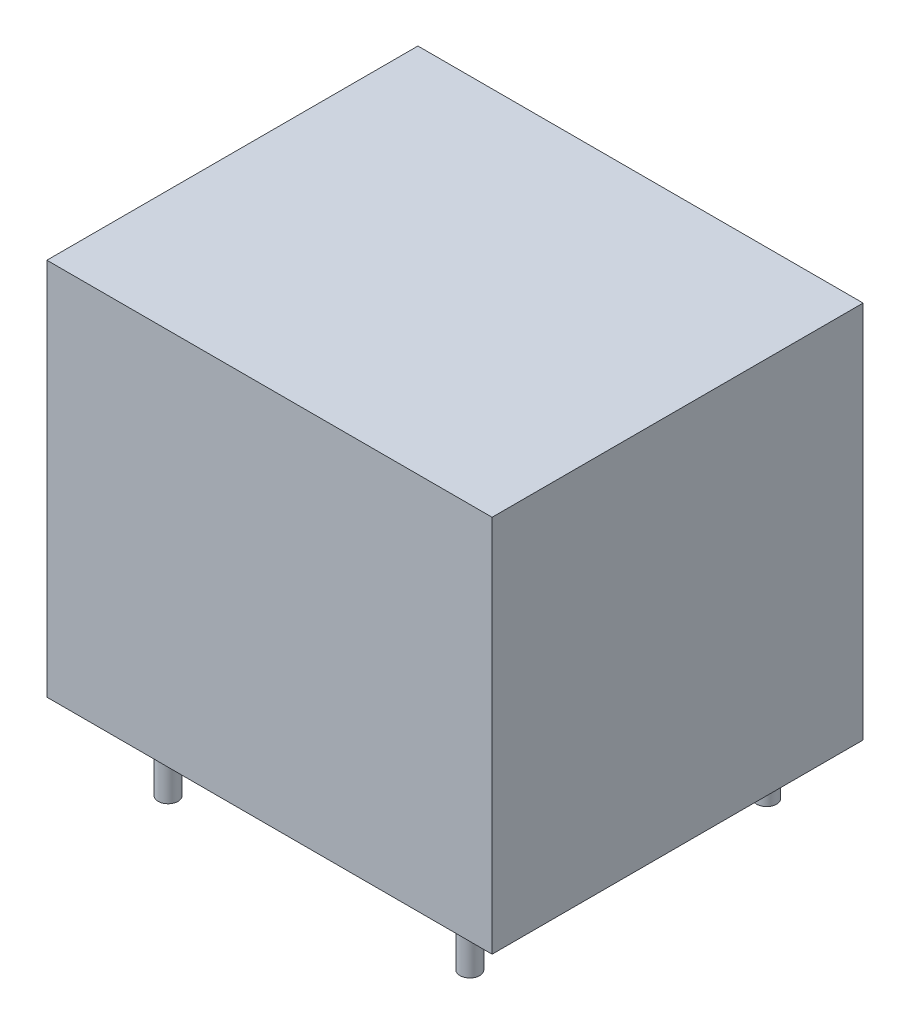
ISO-10303-21;
HEADER;
FILE_DESCRIPTION(('STEP AP214'),'2;1');
FILE_NAME('part.step','',(''),(''),'','','');
FILE_SCHEMA(('AUTOMOTIVE_DESIGN { 1 0 10303 214 1 1 1 1 }'));
ENDSEC;
DATA;
#1=APPLICATION_CONTEXT('core data for automotive mechanical design processes');
#2=APPLICATION_PROTOCOL_DEFINITION('international standard','automotive_design',2000,#1);
#3=PRODUCT_CONTEXT('',#1,'mechanical');
#4=PRODUCT('Part','Part','',(#3));
#5=PRODUCT_RELATED_PRODUCT_CATEGORY('part','',(#4));
#6=PRODUCT_DEFINITION_FORMATION('','',#4);
#7=PRODUCT_DEFINITION_CONTEXT('part definition',#1,'design');
#8=PRODUCT_DEFINITION('design','',#6,#7);
#9=PRODUCT_DEFINITION_SHAPE('','',#8);
#10=(LENGTH_UNIT() NAMED_UNIT(*) SI_UNIT(.MILLI.,.METRE.));
#11=(NAMED_UNIT(*) PLANE_ANGLE_UNIT() SI_UNIT($,.RADIAN.));
#12=(NAMED_UNIT(*) SI_UNIT($,.STERADIAN.) SOLID_ANGLE_UNIT());
#13=UNCERTAINTY_MEASURE_WITH_UNIT(LENGTH_MEASURE(1.E-05),#10,'distance_accuracy_value','');
#14=(GEOMETRIC_REPRESENTATION_CONTEXT(3) GLOBAL_UNCERTAINTY_ASSIGNED_CONTEXT((#13)) GLOBAL_UNIT_ASSIGNED_CONTEXT((#10,
#11,#12)) REPRESENTATION_CONTEXT('',''));
#15=CARTESIAN_POINT('',(0.,0.,0.));
#16=DIRECTION('',(0.,0.,1.));
#17=DIRECTION('',(1.,0.,0.));
#18=AXIS2_PLACEMENT_3D('',#15,#16,#17);
#19=CARTESIAN_POINT('',(-9.,15.3,-7.5));
#20=DIRECTION('',(1.,0.,0.));
#21=DIRECTION('',(0.,0.,-1.));
#22=AXIS2_PLACEMENT_3D('',#19,#20,#21);
#23=PLANE('',#22);
#24=DIRECTION('',(0.,0.,1.));
#25=VECTOR('',#24,1.);
#26=CARTESIAN_POINT('',(-9.,0.,-7.5));
#27=LINE('',#26,#25);
#28=CARTESIAN_POINT('',(-9.,0.,-7.5));
#29=VERTEX_POINT('',#28);
#30=CARTESIAN_POINT('',(-9.,0.,7.5));
#31=VERTEX_POINT('',#30);
#32=EDGE_CURVE('E101',#29,#31,#27,.T.);
#33=ORIENTED_EDGE('',*,*,#32,.T.);
#34=DIRECTION('',(0.,-1.,0.));
#35=VECTOR('',#34,1.);
#36=CARTESIAN_POINT('',(-9.,15.3,7.5));
#37=LINE('',#36,#35);
#38=CARTESIAN_POINT('',(-9.,15.3,7.5));
#39=VERTEX_POINT('',#38);
#40=EDGE_CURVE('E92',#39,#31,#37,.T.);
#41=ORIENTED_EDGE('',*,*,#40,.F.);
#42=DIRECTION('',(0.,0.,1.));
#43=VECTOR('',#42,1.);
#44=CARTESIAN_POINT('',(-9.,15.3,-7.5));
#45=LINE('',#44,#43);
#46=CARTESIAN_POINT('',(-9.,15.3,-7.5));
#47=VERTEX_POINT('',#46);
#48=EDGE_CURVE('E86',#47,#39,#45,.T.);
#49=ORIENTED_EDGE('',*,*,#48,.F.);
#50=DIRECTION('',(0.,-1.,0.));
#51=VECTOR('',#50,1.);
#52=CARTESIAN_POINT('',(-9.,15.3,-7.5));
#53=LINE('',#52,#51);
#54=EDGE_CURVE('E97',#47,#29,#53,.T.);
#55=ORIENTED_EDGE('',*,*,#54,.T.);
#56=EDGE_LOOP('',(#33,#41,#49,#55));
#57=FACE_BOUND('',#56,.T.);
#58=ADVANCED_FACE('F34',(#57),#23,.F.);
#59=CARTESIAN_POINT('',(-9.,15.3,7.5));
#60=DIRECTION('',(0.,0.,-1.));
#61=DIRECTION('',(-1.,0.,0.));
#62=AXIS2_PLACEMENT_3D('',#59,#60,#61);
#63=PLANE('',#62);
#64=DIRECTION('',(1.,0.,0.));
#65=VECTOR('',#64,1.);
#66=CARTESIAN_POINT('',(-9.,0.,7.5));
#67=LINE('',#66,#65);
#68=CARTESIAN_POINT('',(9.,0.,7.5));
#69=VERTEX_POINT('',#68);
#70=EDGE_CURVE('E91',#31,#69,#67,.T.);
#71=ORIENTED_EDGE('',*,*,#70,.T.);
#72=DIRECTION('',(0.,-1.,0.));
#73=VECTOR('',#72,1.);
#74=CARTESIAN_POINT('',(9.,15.3,7.5));
#75=LINE('',#74,#73);
#76=CARTESIAN_POINT('',(9.,15.3,7.5));
#77=VERTEX_POINT('',#76);
#78=EDGE_CURVE('E89',#77,#69,#75,.T.);
#79=ORIENTED_EDGE('',*,*,#78,.F.);
#80=DIRECTION('',(1.,0.,0.));
#81=VECTOR('',#80,1.);
#82=CARTESIAN_POINT('',(-9.,15.3,7.5));
#83=LINE('',#82,#81);
#84=EDGE_CURVE('E81',#39,#77,#83,.T.);
#85=ORIENTED_EDGE('',*,*,#84,.F.);
#86=ORIENTED_EDGE('',*,*,#40,.T.);
#87=EDGE_LOOP('',(#71,#79,#85,#86));
#88=FACE_BOUND('',#87,.T.);
#89=ADVANCED_FACE('F90',(#88),#63,.F.);
#90=CARTESIAN_POINT('',(9.,15.3,-7.5));
#91=DIRECTION('',(-1.,0.,0.));
#92=DIRECTION('',(0.,0.,1.));
#93=AXIS2_PLACEMENT_3D('',#90,#91,#92);
#94=PLANE('',#93);
#95=DIRECTION('',(0.,0.,-1.));
#96=VECTOR('',#95,1.);
#97=CARTESIAN_POINT('',(9.,0.,-7.5));
#98=LINE('',#97,#96);
#99=CARTESIAN_POINT('',(9.,0.,-7.5));
#100=VERTEX_POINT('',#99);
#101=EDGE_CURVE('E67',#69,#100,#98,.T.);
#102=ORIENTED_EDGE('',*,*,#101,.T.);
#103=DIRECTION('',(0.,-1.,0.));
#104=VECTOR('',#103,1.);
#105=CARTESIAN_POINT('',(9.,15.3,-7.5));
#106=LINE('',#105,#104);
#107=CARTESIAN_POINT('',(9.,15.3,-7.5));
#108=VERTEX_POINT('',#107);
#109=EDGE_CURVE('E93',#108,#100,#106,.T.);
#110=ORIENTED_EDGE('',*,*,#109,.F.);
#111=DIRECTION('',(0.,0.,-1.));
#112=VECTOR('',#111,1.);
#113=CARTESIAN_POINT('',(9.,15.3,-7.5));
#114=LINE('',#113,#112);
#115=EDGE_CURVE('E84',#77,#108,#114,.T.);
#116=ORIENTED_EDGE('',*,*,#115,.F.);
#117=ORIENTED_EDGE('',*,*,#78,.T.);
#118=EDGE_LOOP('',(#102,#110,#116,#117));
#119=FACE_BOUND('',#118,.T.);
#120=ADVANCED_FACE('F95',(#119),#94,.F.);
#121=CARTESIAN_POINT('',(-9.,15.3,-7.5));
#122=DIRECTION('',(0.,0.,1.));
#123=DIRECTION('',(1.,0.,0.));
#124=AXIS2_PLACEMENT_3D('',#121,#122,#123);
#125=PLANE('',#124);
#126=DIRECTION('',(-1.,0.,0.));
#127=VECTOR('',#126,1.);
#128=CARTESIAN_POINT('',(-9.,0.,-7.5));
#129=LINE('',#128,#127);
#130=EDGE_CURVE('E73',#100,#29,#129,.T.);
#131=ORIENTED_EDGE('',*,*,#130,.T.);
#132=ORIENTED_EDGE('',*,*,#54,.F.);
#133=DIRECTION('',(-1.,0.,0.));
#134=VECTOR('',#133,1.);
#135=CARTESIAN_POINT('',(-9.,15.3,-7.5));
#136=LINE('',#135,#134);
#137=EDGE_CURVE('E50',#108,#47,#136,.T.);
#138=ORIENTED_EDGE('',*,*,#137,.F.);
#139=ORIENTED_EDGE('',*,*,#109,.T.);
#140=EDGE_LOOP('',(#131,#132,#138,#139));
#141=FACE_BOUND('',#140,.T.);
#142=ADVANCED_FACE('F138',(#141),#125,.F.);
#143=CARTESIAN_POINT('',(0.,15.3,0.));
#144=DIRECTION('',(0.,1.,0.));
#145=DIRECTION('',(0.,0.,1.));
#146=AXIS2_PLACEMENT_3D('',#143,#144,#145);
#147=PLANE('',#146);
#148=ORIENTED_EDGE('',*,*,#48,.T.);
#149=ORIENTED_EDGE('',*,*,#84,.T.);
#150=ORIENTED_EDGE('',*,*,#115,.T.);
#151=ORIENTED_EDGE('',*,*,#137,.T.);
#152=EDGE_LOOP('',(#148,#149,#150,#151));
#153=FACE_BOUND('',#152,.T.);
#154=ADVANCED_FACE('F82',(#153),#147,.T.);
#155=CARTESIAN_POINT('',(0.,0.,0.));
#156=DIRECTION('',(0.,1.,0.));
#157=DIRECTION('',(0.,0.,1.));
#158=AXIS2_PLACEMENT_3D('',#155,#156,#157);
#159=PLANE('',#158);
#160=CARTESIAN_POINT('',(6.6,0.,-6.));
#161=DIRECTION('',(0.,1.,0.));
#162=DIRECTION('',(0.,0.,1.));
#163=AXIS2_PLACEMENT_3D('',#160,#161,#162);
#164=CIRCLE('',#163,0.4);
#165=CARTESIAN_POINT('',(6.6,0.,-5.6));
#166=VERTEX_POINT('',#165);
#167=EDGE_CURVE('E11',#166,#166,#164,.F.);
#168=ORIENTED_EDGE('',*,*,#167,.F.);
#169=EDGE_LOOP('',(#168));
#170=FACE_BOUND('',#169,.T.);
#171=CARTESIAN_POINT('',(6.6,0.,6.));
#172=DIRECTION('',(0.,1.,0.));
#173=DIRECTION('',(0.,0.,1.));
#174=AXIS2_PLACEMENT_3D('',#171,#172,#173);
#175=CIRCLE('',#174,0.4);
#176=CARTESIAN_POINT('',(6.6,0.,6.4));
#177=VERTEX_POINT('',#176);
#178=EDGE_CURVE('E42',#177,#177,#175,.F.);
#179=ORIENTED_EDGE('',*,*,#178,.F.);
#180=EDGE_LOOP('',(#179));
#181=FACE_BOUND('',#180,.T.);
#182=CARTESIAN_POINT('',(-5.6,0.,-6.));
#183=DIRECTION('',(0.,1.,0.));
#184=DIRECTION('',(0.,0.,1.));
#185=AXIS2_PLACEMENT_3D('',#182,#183,#184);
#186=CIRCLE('',#185,0.4);
#187=CARTESIAN_POINT('',(-5.6,0.,-5.6));
#188=VERTEX_POINT('',#187);
#189=EDGE_CURVE('E117',#188,#188,#186,.F.);
#190=ORIENTED_EDGE('',*,*,#189,.F.);
#191=EDGE_LOOP('',(#190));
#192=FACE_BOUND('',#191,.T.);
#193=CARTESIAN_POINT('',(-7.6,0.,0.));
#194=DIRECTION('',(0.,1.,0.));
#195=DIRECTION('',(0.,0.,1.));
#196=AXIS2_PLACEMENT_3D('',#193,#194,#195);
#197=CIRCLE('',#196,0.4);
#198=CARTESIAN_POINT('',(-7.6,0.,0.4));
#199=VERTEX_POINT('',#198);
#200=EDGE_CURVE('E114',#199,#199,#197,.F.);
#201=ORIENTED_EDGE('',*,*,#200,.F.);
#202=EDGE_LOOP('',(#201));
#203=FACE_BOUND('',#202,.T.);
#204=CARTESIAN_POINT('',(-5.6,0.,6.));
#205=DIRECTION('',(0.,1.,0.));
#206=DIRECTION('',(0.,0.,1.));
#207=AXIS2_PLACEMENT_3D('',#204,#205,#206);
#208=CIRCLE('',#207,0.4);
#209=CARTESIAN_POINT('',(-5.6,0.,6.4));
#210=VERTEX_POINT('',#209);
#211=EDGE_CURVE('E111',#210,#210,#208,.F.);
#212=ORIENTED_EDGE('',*,*,#211,.F.);
#213=EDGE_LOOP('',(#212));
#214=FACE_BOUND('',#213,.T.);
#215=ORIENTED_EDGE('',*,*,#32,.F.);
#216=ORIENTED_EDGE('',*,*,#130,.F.);
#217=ORIENTED_EDGE('',*,*,#101,.F.);
#218=ORIENTED_EDGE('',*,*,#70,.F.);
#219=EDGE_LOOP('',(#215,#216,#217,#218));
#220=FACE_BOUND('',#219,.T.);
#221=ADVANCED_FACE('F124',(#170,#181,#192,#203,#214,#220),#159,.F.);
#222=CARTESIAN_POINT('',(-5.6,-2.5,6.));
#223=DIRECTION('',(0.,1.,0.));
#224=DIRECTION('',(0.,0.,1.));
#225=AXIS2_PLACEMENT_3D('',#222,#223,#224);
#226=CYLINDRICAL_SURFACE('',#225,0.4);
#227=CARTESIAN_POINT('',(-5.6,-2.5,6.));
#228=DIRECTION('',(0.,-1.,0.));
#229=DIRECTION('',(0.,0.,-1.));
#230=AXIS2_PLACEMENT_3D('',#227,#228,#229);
#231=CIRCLE('',#230,0.4);
#232=CARTESIAN_POINT('',(-5.6,-2.5,5.6));
#233=VERTEX_POINT('',#232);
#234=EDGE_CURVE('E104',#233,#233,#231,.T.);
#235=ORIENTED_EDGE('',*,*,#234,.F.);
#236=EDGE_LOOP('',(#235));
#237=FACE_BOUND('',#236,.T.);
#238=ORIENTED_EDGE('',*,*,#211,.T.);
#239=EDGE_LOOP('',(#238));
#240=FACE_BOUND('',#239,.T.);
#241=ADVANCED_FACE('F127',(#237,#240),#226,.T.);
#242=CARTESIAN_POINT('',(-5.6,-2.5,6.));
#243=DIRECTION('',(0.,-1.,0.));
#244=DIRECTION('',(0.,0.,-1.));
#245=AXIS2_PLACEMENT_3D('',#242,#243,#244);
#246=PLANE('',#245);
#247=ORIENTED_EDGE('',*,*,#234,.T.);
#248=EDGE_LOOP('',(#247));
#249=FACE_BOUND('',#248,.T.);
#250=ADVANCED_FACE('F183',(#249),#246,.T.);
#251=CARTESIAN_POINT('',(-7.6,-2.5,0.));
#252=DIRECTION('',(0.,1.,0.));
#253=DIRECTION('',(0.,0.,1.));
#254=AXIS2_PLACEMENT_3D('',#251,#252,#253);
#255=CYLINDRICAL_SURFACE('',#254,0.4);
#256=CARTESIAN_POINT('',(-7.6,-2.5,0.));
#257=DIRECTION('',(0.,-1.,0.));
#258=DIRECTION('',(0.,0.,-1.));
#259=AXIS2_PLACEMENT_3D('',#256,#257,#258);
#260=CIRCLE('',#259,0.4);
#261=CARTESIAN_POINT('',(-7.6,-2.5,-0.399999999999999));
#262=VERTEX_POINT('',#261);
#263=EDGE_CURVE('E287',#262,#262,#260,.T.);
#264=ORIENTED_EDGE('',*,*,#263,.F.);
#265=EDGE_LOOP('',(#264));
#266=FACE_BOUND('',#265,.T.);
#267=ORIENTED_EDGE('',*,*,#200,.T.);
#268=EDGE_LOOP('',(#267));
#269=FACE_BOUND('',#268,.T.);
#270=ADVANCED_FACE('F193',(#266,#269),#255,.T.);
#271=CARTESIAN_POINT('',(-7.6,-2.5,0.));
#272=DIRECTION('',(0.,-1.,0.));
#273=DIRECTION('',(0.,0.,-1.));
#274=AXIS2_PLACEMENT_3D('',#271,#272,#273);
#275=PLANE('',#274);
#276=ORIENTED_EDGE('',*,*,#263,.T.);
#277=EDGE_LOOP('',(#276));
#278=FACE_BOUND('',#277,.T.);
#279=ADVANCED_FACE('F203',(#278),#275,.T.);
#280=CARTESIAN_POINT('',(-5.6,-2.5,-6.));
#281=DIRECTION('',(0.,1.,0.));
#282=DIRECTION('',(0.,0.,1.));
#283=AXIS2_PLACEMENT_3D('',#280,#281,#282);
#284=CYLINDRICAL_SURFACE('',#283,0.4);
#285=CARTESIAN_POINT('',(-5.6,-2.5,-6.));
#286=DIRECTION('',(0.,-1.,0.));
#287=DIRECTION('',(0.,0.,-1.));
#288=AXIS2_PLACEMENT_3D('',#285,#286,#287);
#289=CIRCLE('',#288,0.4);
#290=CARTESIAN_POINT('',(-5.6,-2.5,-6.4));
#291=VERTEX_POINT('',#290);
#292=EDGE_CURVE('E282',#291,#291,#289,.T.);
#293=ORIENTED_EDGE('',*,*,#292,.F.);
#294=EDGE_LOOP('',(#293));
#295=FACE_BOUND('',#294,.T.);
#296=ORIENTED_EDGE('',*,*,#189,.T.);
#297=EDGE_LOOP('',(#296));
#298=FACE_BOUND('',#297,.T.);
#299=ADVANCED_FACE('F213',(#295,#298),#284,.T.);
#300=CARTESIAN_POINT('',(-5.6,-2.5,-6.));
#301=DIRECTION('',(0.,-1.,0.));
#302=DIRECTION('',(0.,0.,-1.));
#303=AXIS2_PLACEMENT_3D('',#300,#301,#302);
#304=PLANE('',#303);
#305=ORIENTED_EDGE('',*,*,#292,.T.);
#306=EDGE_LOOP('',(#305));
#307=FACE_BOUND('',#306,.T.);
#308=ADVANCED_FACE('F223',(#307),#304,.T.);
#309=CARTESIAN_POINT('',(6.6,-2.5,6.));
#310=DIRECTION('',(0.,1.,0.));
#311=DIRECTION('',(0.,0.,1.));
#312=AXIS2_PLACEMENT_3D('',#309,#310,#311);
#313=CYLINDRICAL_SURFACE('',#312,0.4);
#314=CARTESIAN_POINT('',(6.6,-2.5,6.));
#315=DIRECTION('',(0.,-1.,0.));
#316=DIRECTION('',(0.,0.,-1.));
#317=AXIS2_PLACEMENT_3D('',#314,#315,#316);
#318=CIRCLE('',#317,0.4);
#319=CARTESIAN_POINT('',(6.6,-2.5,5.6));
#320=VERTEX_POINT('',#319);
#321=EDGE_CURVE('E279',#320,#320,#318,.T.);
#322=ORIENTED_EDGE('',*,*,#321,.F.);
#323=EDGE_LOOP('',(#322));
#324=FACE_BOUND('',#323,.T.);
#325=ORIENTED_EDGE('',*,*,#178,.T.);
#326=EDGE_LOOP('',(#325));
#327=FACE_BOUND('',#326,.T.);
#328=ADVANCED_FACE('F122',(#324,#327),#313,.T.);
#329=CARTESIAN_POINT('',(6.6,-2.5,6.));
#330=DIRECTION('',(0.,-1.,0.));
#331=DIRECTION('',(0.,0.,-1.));
#332=AXIS2_PLACEMENT_3D('',#329,#330,#331);
#333=PLANE('',#332);
#334=ORIENTED_EDGE('',*,*,#321,.T.);
#335=EDGE_LOOP('',(#334));
#336=FACE_BOUND('',#335,.T.);
#337=ADVANCED_FACE('F242',(#336),#333,.T.);
#338=CARTESIAN_POINT('',(6.6,-2.5,-6.));
#339=DIRECTION('',(0.,1.,0.));
#340=DIRECTION('',(0.,0.,1.));
#341=AXIS2_PLACEMENT_3D('',#338,#339,#340);
#342=CYLINDRICAL_SURFACE('',#341,0.4);
#343=CARTESIAN_POINT('',(6.6,-2.5,-6.));
#344=DIRECTION('',(0.,-1.,0.));
#345=DIRECTION('',(0.,0.,-1.));
#346=AXIS2_PLACEMENT_3D('',#343,#344,#345);
#347=CIRCLE('',#346,0.4);
#348=CARTESIAN_POINT('',(6.6,-2.5,-6.4));
#349=VERTEX_POINT('',#348);
#350=EDGE_CURVE('E278',#349,#349,#347,.T.);
#351=ORIENTED_EDGE('',*,*,#350,.F.);
#352=EDGE_LOOP('',(#351));
#353=FACE_BOUND('',#352,.T.);
#354=ORIENTED_EDGE('',*,*,#167,.T.);
#355=EDGE_LOOP('',(#354));
#356=FACE_BOUND('',#355,.T.);
#357=ADVANCED_FACE('F252',(#353,#356),#342,.T.);
#358=CARTESIAN_POINT('',(6.6,-2.5,-6.));
#359=DIRECTION('',(0.,-1.,0.));
#360=DIRECTION('',(0.,0.,-1.));
#361=AXIS2_PLACEMENT_3D('',#358,#359,#360);
#362=PLANE('',#361);
#363=ORIENTED_EDGE('',*,*,#350,.T.);
#364=EDGE_LOOP('',(#363));
#365=FACE_BOUND('',#364,.T.);
#366=ADVANCED_FACE('F262',(#365),#362,.T.);
#367=CLOSED_SHELL('',(#58,#89,#120,#142,#154,#221,#241,#250,#270,#279,#299,#308,#328,#337,#357,#366));
#368=MANIFOLD_SOLID_BREP('B2',#367);
#369=ADVANCED_BREP_SHAPE_REPRESENTATION('',(#18,#368),#14);
#370=SHAPE_DEFINITION_REPRESENTATION(#9,#369);
ENDSEC;
END-ISO-10303-21;
